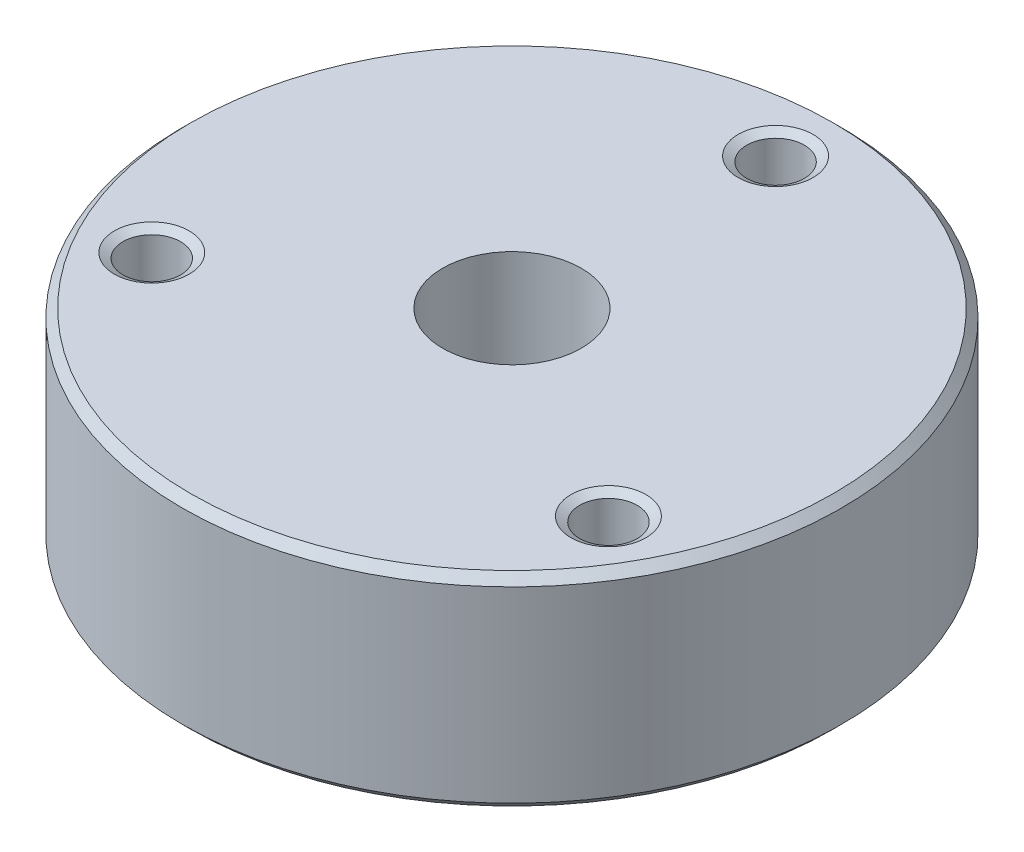
ISO-10303-21;
HEADER;
FILE_DESCRIPTION(('STEP AP214'),'2;1');
FILE_NAME('part.step','',(''),(''),'','','');
FILE_SCHEMA(('AUTOMOTIVE_DESIGN { 1 0 10303 214 1 1 1 1 }'));
ENDSEC;
DATA;
#1=APPLICATION_CONTEXT('core data for automotive mechanical design processes');
#2=APPLICATION_PROTOCOL_DEFINITION('international standard','automotive_design',2000,#1);
#3=PRODUCT_CONTEXT('',#1,'mechanical');
#4=PRODUCT('Part','Part','',(#3));
#5=PRODUCT_RELATED_PRODUCT_CATEGORY('part','',(#4));
#6=PRODUCT_DEFINITION_FORMATION('','',#4);
#7=PRODUCT_DEFINITION_CONTEXT('part definition',#1,'design');
#8=PRODUCT_DEFINITION('design','',#6,#7);
#9=PRODUCT_DEFINITION_SHAPE('','',#8);
#10=(LENGTH_UNIT() NAMED_UNIT(*) SI_UNIT(.MILLI.,.METRE.));
#11=(NAMED_UNIT(*) PLANE_ANGLE_UNIT() SI_UNIT($,.RADIAN.));
#12=(NAMED_UNIT(*) SI_UNIT($,.STERADIAN.) SOLID_ANGLE_UNIT());
#13=UNCERTAINTY_MEASURE_WITH_UNIT(LENGTH_MEASURE(1.E-05),#10,'distance_accuracy_value','');
#14=(GEOMETRIC_REPRESENTATION_CONTEXT(3) GLOBAL_UNCERTAINTY_ASSIGNED_CONTEXT((#13)) GLOBAL_UNIT_ASSIGNED_CONTEXT((#10,
#11,#12)) REPRESENTATION_CONTEXT('',''));
#15=CARTESIAN_POINT('',(0.,0.,0.));
#16=DIRECTION('',(0.,0.,1.));
#17=DIRECTION('',(1.,0.,0.));
#18=AXIS2_PLACEMENT_3D('',#15,#16,#17);
#19=CARTESIAN_POINT('',(0.,9.3345,0.));
#20=DIRECTION('',(0.,-1.,0.));
#21=DIRECTION('',(0.,0.,-1.));
#22=AXIS2_PLACEMENT_3D('',#19,#20,#21);
#23=CYLINDRICAL_SURFACE('',#22,30.1625);
#24=CARTESIAN_POINT('',(0.,-8.57249999999998,0.));
#25=DIRECTION('',(0.,1.,0.));
#26=DIRECTION('',(0.,0.,1.));
#27=AXIS2_PLACEMENT_3D('',#24,#25,#26);
#28=CIRCLE('',#27,30.1625);
#29=CARTESIAN_POINT('',(0.,-8.57249999999998,30.1625));
#30=VERTEX_POINT('',#29);
#31=EDGE_CURVE('E46',#30,#30,#28,.T.);
#32=ORIENTED_EDGE('',*,*,#31,.T.);
#33=EDGE_LOOP('',(#32));
#34=FACE_BOUND('',#33,.T.);
#35=CARTESIAN_POINT('',(0.,8.5725,0.));
#36=DIRECTION('',(0.,1.,0.));
#37=DIRECTION('',(0.,0.,1.));
#38=AXIS2_PLACEMENT_3D('',#35,#36,#37);
#39=CIRCLE('',#38,30.1625);
#40=CARTESIAN_POINT('',(0.,8.5725,30.1625));
#41=VERTEX_POINT('',#40);
#42=EDGE_CURVE('E111',#41,#41,#39,.F.);
#43=ORIENTED_EDGE('',*,*,#42,.T.);
#44=EDGE_LOOP('',(#43));
#45=FACE_BOUND('',#44,.T.);
#46=ADVANCED_FACE('F33',(#34,#45),#23,.T.);
#47=CARTESIAN_POINT('',(0.,9.3345,0.));
#48=DIRECTION('',(0.,1.,0.));
#49=DIRECTION('',(0.,0.,1.));
#50=AXIS2_PLACEMENT_3D('',#47,#48,#49);
#51=PLANE('',#50);
#52=CARTESIAN_POINT('',(0.,9.3345,0.));
#53=DIRECTION('',(0.,1.,0.));
#54=DIRECTION('',(0.,0.,1.));
#55=AXIS2_PLACEMENT_3D('',#52,#53,#54);
#56=CIRCLE('',#55,29.4005);
#57=CARTESIAN_POINT('',(0.,9.3345,29.4005));
#58=VERTEX_POINT('',#57);
#59=EDGE_CURVE('E10',#58,#58,#56,.T.);
#60=ORIENTED_EDGE('',*,*,#59,.T.);
#61=EDGE_LOOP('',(#60));
#62=FACE_BOUND('',#61,.T.);
#63=CARTESIAN_POINT('',(0.,9.3345,0.));
#64=DIRECTION('',(0.,-1.,0.));
#65=DIRECTION('',(0.,0.,-1.));
#66=AXIS2_PLACEMENT_3D('',#63,#64,#65);
#67=CIRCLE('',#66,6.34873);
#68=CARTESIAN_POINT('',(0.,9.3345,-6.34873));
#69=VERTEX_POINT('',#68);
#70=EDGE_CURVE('E55',#69,#69,#67,.T.);
#71=ORIENTED_EDGE('',*,*,#70,.T.);
#72=EDGE_LOOP('',(#71));
#73=FACE_BOUND('',#72,.T.);
#74=CARTESIAN_POINT('',(-20.8971929933186,9.3345,12.0649999999998));
#75=DIRECTION('',(0.,1.,0.));
#76=DIRECTION('',(0.,0.,1.));
#77=AXIS2_PLACEMENT_3D('',#74,#75,#76);
#78=CIRCLE('',#77,3.429);
#79=CARTESIAN_POINT('',(-20.8971929933186,9.3345,15.4939999999998));
#80=VERTEX_POINT('',#79);
#81=EDGE_CURVE('E66',#80,#80,#78,.T.);
#82=ORIENTED_EDGE('',*,*,#81,.F.);
#83=EDGE_LOOP('',(#82));
#84=FACE_BOUND('',#83,.T.);
#85=CARTESIAN_POINT('',(20.8971929933185,9.3345,12.0650000000001));
#86=DIRECTION('',(0.,1.,0.));
#87=DIRECTION('',(0.,0.,1.));
#88=AXIS2_PLACEMENT_3D('',#85,#86,#87);
#89=CIRCLE('',#88,3.429);
#90=CARTESIAN_POINT('',(20.8971929933185,9.3345,15.4940000000001));
#91=VERTEX_POINT('',#90);
#92=EDGE_CURVE('E81',#91,#91,#89,.T.);
#93=ORIENTED_EDGE('',*,*,#92,.F.);
#94=EDGE_LOOP('',(#93));
#95=FACE_BOUND('',#94,.T.);
#96=CARTESIAN_POINT('',(0.,9.3345,-24.13));
#97=DIRECTION('',(0.,1.,0.));
#98=DIRECTION('',(0.,0.,1.));
#99=AXIS2_PLACEMENT_3D('',#96,#97,#98);
#100=CIRCLE('',#99,3.429);
#101=CARTESIAN_POINT('',(0.,9.3345,-20.701));
#102=VERTEX_POINT('',#101);
#103=EDGE_CURVE('E96',#102,#102,#100,.T.);
#104=ORIENTED_EDGE('',*,*,#103,.F.);
#105=EDGE_LOOP('',(#104));
#106=FACE_BOUND('',#105,.T.);
#107=ADVANCED_FACE('F133',(#62,#73,#84,#95,#106),#51,.T.);
#108=CARTESIAN_POINT('',(0.,-9.3345,0.));
#109=DIRECTION('',(0.,1.,0.));
#110=DIRECTION('',(0.,0.,1.));
#111=AXIS2_PLACEMENT_3D('',#108,#109,#110);
#112=PLANE('',#111);
#113=CARTESIAN_POINT('',(0.,-9.3345,0.));
#114=DIRECTION('',(0.,1.,0.));
#115=DIRECTION('',(0.,0.,1.));
#116=AXIS2_PLACEMENT_3D('',#113,#114,#115);
#117=CIRCLE('',#116,29.4005);
#118=CARTESIAN_POINT('',(0.,-9.3345,29.4005));
#119=VERTEX_POINT('',#118);
#120=EDGE_CURVE('E41',#119,#119,#117,.F.);
#121=ORIENTED_EDGE('',*,*,#120,.T.);
#122=EDGE_LOOP('',(#121));
#123=FACE_BOUND('',#122,.T.);
#124=CARTESIAN_POINT('',(0.,-9.3345,0.));
#125=DIRECTION('',(0.,-1.,0.));
#126=DIRECTION('',(0.,0.,-1.));
#127=AXIS2_PLACEMENT_3D('',#124,#125,#126);
#128=CIRCLE('',#127,7.112);
#129=CARTESIAN_POINT('',(0.,-9.3345,-7.112));
#130=VERTEX_POINT('',#129);
#131=EDGE_CURVE('E63',#130,#130,#128,.T.);
#132=ORIENTED_EDGE('',*,*,#131,.F.);
#133=EDGE_LOOP('',(#132));
#134=FACE_BOUND('',#133,.T.);
#135=CARTESIAN_POINT('',(-20.8971929933186,-9.33449999999999,12.0649999999998));
#136=DIRECTION('',(0.,1.,0.));
#137=DIRECTION('',(0.,0.,1.));
#138=AXIS2_PLACEMENT_3D('',#135,#136,#137);
#139=CIRCLE('',#138,2.1971);
#140=CARTESIAN_POINT('',(-20.8971929933186,-9.33449999999999,14.2620999999998));
#141=VERTEX_POINT('',#140);
#142=EDGE_CURVE('E78',#141,#141,#139,.T.);
#143=ORIENTED_EDGE('',*,*,#142,.T.);
#144=EDGE_LOOP('',(#143));
#145=FACE_BOUND('',#144,.T.);
#146=CARTESIAN_POINT('',(20.8971929933185,-9.33449999999999,12.0650000000001));
#147=DIRECTION('',(0.,1.,0.));
#148=DIRECTION('',(0.,0.,1.));
#149=AXIS2_PLACEMENT_3D('',#146,#147,#148);
#150=CIRCLE('',#149,2.1971);
#151=CARTESIAN_POINT('',(20.8971929933185,-9.33449999999999,14.2621000000001));
#152=VERTEX_POINT('',#151);
#153=EDGE_CURVE('E93',#152,#152,#150,.T.);
#154=ORIENTED_EDGE('',*,*,#153,.T.);
#155=EDGE_LOOP('',(#154));
#156=FACE_BOUND('',#155,.T.);
#157=CARTESIAN_POINT('',(0.,-9.33449999999999,-24.13));
#158=DIRECTION('',(0.,1.,0.));
#159=DIRECTION('',(0.,0.,1.));
#160=AXIS2_PLACEMENT_3D('',#157,#158,#159);
#161=CIRCLE('',#160,2.19710000000001);
#162=CARTESIAN_POINT('',(0.,-9.33449999999999,-21.9329));
#163=VERTEX_POINT('',#162);
#164=EDGE_CURVE('E108',#163,#163,#161,.T.);
#165=ORIENTED_EDGE('',*,*,#164,.T.);
#166=EDGE_LOOP('',(#165));
#167=FACE_BOUND('',#166,.T.);
#168=ADVANCED_FACE('F137',(#123,#134,#145,#156,#167),#112,.F.);
#169=CARTESIAN_POINT('',(0.,9.3345,-24.13));
#170=DIRECTION('',(0.,1.,0.));
#171=DIRECTION('',(0.,0.,1.));
#172=AXIS2_PLACEMENT_3D('',#169,#170,#171);
#173=CYLINDRICAL_SURFACE('',#172,2.1971);
#174=ORIENTED_EDGE('',*,*,#164,.F.);
#175=EDGE_LOOP('',(#174));
#176=FACE_BOUND('',#175,.T.);
#177=CARTESIAN_POINT('',(0.,-1.0287,-24.13));
#178=DIRECTION('',(0.,1.,0.));
#179=DIRECTION('',(0.,0.,1.));
#180=AXIS2_PLACEMENT_3D('',#177,#178,#179);
#181=CIRCLE('',#180,2.1971);
#182=CARTESIAN_POINT('',(0.,-1.0287,-21.9329));
#183=VERTEX_POINT('',#182);
#184=EDGE_CURVE('E105',#183,#183,#181,.T.);
#185=ORIENTED_EDGE('',*,*,#184,.T.);
#186=EDGE_LOOP('',(#185));
#187=FACE_BOUND('',#186,.T.);
#188=ADVANCED_FACE('F141',(#176,#187),#173,.F.);
#189=CARTESIAN_POINT('',(2.63778999999999,-1.0287,-24.13));
#190=DIRECTION('',(0.,-1.,0.));
#191=DIRECTION('',(0.,0.,-1.));
#192=AXIS2_PLACEMENT_3D('',#189,#190,#191);
#193=PLANE('',#192);
#194=ORIENTED_EDGE('',*,*,#184,.F.);
#195=EDGE_LOOP('',(#194));
#196=FACE_BOUND('',#195,.T.);
#197=CARTESIAN_POINT('',(0.,-1.0287,-24.13));
#198=DIRECTION('',(0.,1.,0.));
#199=DIRECTION('',(0.,0.,1.));
#200=AXIS2_PLACEMENT_3D('',#197,#198,#199);
#201=CIRCLE('',#200,2.63778999999999);
#202=CARTESIAN_POINT('',(0.,-1.0287,-21.49221));
#203=VERTEX_POINT('',#202);
#204=EDGE_CURVE('E102',#203,#203,#201,.T.);
#205=ORIENTED_EDGE('',*,*,#204,.T.);
#206=EDGE_LOOP('',(#205));
#207=FACE_BOUND('',#206,.T.);
#208=ADVANCED_FACE('F146',(#196,#207),#193,.F.);
#209=CARTESIAN_POINT('',(0.,9.3345,-24.13));
#210=DIRECTION('',(0.,1.,0.));
#211=DIRECTION('',(0.,0.,1.));
#212=AXIS2_PLACEMENT_3D('',#209,#210,#211);
#213=CYLINDRICAL_SURFACE('',#212,2.63779);
#214=ORIENTED_EDGE('',*,*,#204,.F.);
#215=EDGE_LOOP('',(#214));
#216=FACE_BOUND('',#215,.T.);
#217=CARTESIAN_POINT('',(0.,8.87769469351447,-24.13));
#218=DIRECTION('',(0.,1.,0.));
#219=DIRECTION('',(0.,0.,1.));
#220=AXIS2_PLACEMENT_3D('',#217,#218,#219);
#221=CIRCLE('',#220,2.63779);
#222=CARTESIAN_POINT('',(0.,8.87769469351447,-21.49221));
#223=VERTEX_POINT('',#222);
#224=EDGE_CURVE('E99',#223,#223,#221,.T.);
#225=ORIENTED_EDGE('',*,*,#224,.T.);
#226=EDGE_LOOP('',(#225));
#227=FACE_BOUND('',#226,.T.);
#228=ADVANCED_FACE('F150',(#216,#227),#213,.F.);
#229=CARTESIAN_POINT('',(0.,9.3345,-24.13));
#230=DIRECTION('',(0.,1.,0.));
#231=DIRECTION('',(0.,0.,1.));
#232=AXIS2_PLACEMENT_3D('',#229,#230,#231);
#233=CONICAL_SURFACE('',#232,3.429,1.0471975511966);
#234=ORIENTED_EDGE('',*,*,#224,.F.);
#235=EDGE_LOOP('',(#234));
#236=FACE_BOUND('',#235,.T.);
#237=ORIENTED_EDGE('',*,*,#103,.T.);
#238=EDGE_LOOP('',(#237));
#239=FACE_BOUND('',#238,.T.);
#240=ADVANCED_FACE('F154',(#236,#239),#233,.F.);
#241=CARTESIAN_POINT('',(20.8971929933185,9.3345,12.0650000000001));
#242=DIRECTION('',(0.,1.,0.));
#243=DIRECTION('',(0.,0.,1.));
#244=AXIS2_PLACEMENT_3D('',#241,#242,#243);
#245=CYLINDRICAL_SURFACE('',#244,2.1971);
#246=ORIENTED_EDGE('',*,*,#153,.F.);
#247=EDGE_LOOP('',(#246));
#248=FACE_BOUND('',#247,.T.);
#249=CARTESIAN_POINT('',(20.8971929933185,-1.0287,12.0650000000001));
#250=DIRECTION('',(0.,1.,0.));
#251=DIRECTION('',(0.,0.,1.));
#252=AXIS2_PLACEMENT_3D('',#249,#250,#251);
#253=CIRCLE('',#252,2.1971);
#254=CARTESIAN_POINT('',(20.8971929933185,-1.0287,14.2621000000001));
#255=VERTEX_POINT('',#254);
#256=EDGE_CURVE('E90',#255,#255,#253,.T.);
#257=ORIENTED_EDGE('',*,*,#256,.T.);
#258=EDGE_LOOP('',(#257));
#259=FACE_BOUND('',#258,.T.);
#260=ADVANCED_FACE('F158',(#248,#259),#245,.F.);
#261=CARTESIAN_POINT('',(23.5349829933184,-1.0287,12.0650000000001));
#262=DIRECTION('',(0.,-1.,0.));
#263=DIRECTION('',(0.,0.,-1.));
#264=AXIS2_PLACEMENT_3D('',#261,#262,#263);
#265=PLANE('',#264);
#266=ORIENTED_EDGE('',*,*,#256,.F.);
#267=EDGE_LOOP('',(#266));
#268=FACE_BOUND('',#267,.T.);
#269=CARTESIAN_POINT('',(20.8971929933185,-1.0287,12.0650000000001));
#270=DIRECTION('',(0.,1.,0.));
#271=DIRECTION('',(0.,0.,1.));
#272=AXIS2_PLACEMENT_3D('',#269,#270,#271);
#273=CIRCLE('',#272,2.63778999999999);
#274=CARTESIAN_POINT('',(20.8971929933185,-1.0287,14.7027900000001));
#275=VERTEX_POINT('',#274);
#276=EDGE_CURVE('E87',#275,#275,#273,.T.);
#277=ORIENTED_EDGE('',*,*,#276,.T.);
#278=EDGE_LOOP('',(#277));
#279=FACE_BOUND('',#278,.T.);
#280=ADVANCED_FACE('F162',(#268,#279),#265,.F.);
#281=CARTESIAN_POINT('',(20.8971929933185,9.3345,12.0650000000001));
#282=DIRECTION('',(0.,1.,0.));
#283=DIRECTION('',(0.,0.,1.));
#284=AXIS2_PLACEMENT_3D('',#281,#282,#283);
#285=CYLINDRICAL_SURFACE('',#284,2.63779);
#286=ORIENTED_EDGE('',*,*,#276,.F.);
#287=EDGE_LOOP('',(#286));
#288=FACE_BOUND('',#287,.T.);
#289=CARTESIAN_POINT('',(20.8971929933185,8.87769469351447,12.0650000000001));
#290=DIRECTION('',(0.,1.,0.));
#291=DIRECTION('',(0.,0.,1.));
#292=AXIS2_PLACEMENT_3D('',#289,#290,#291);
#293=CIRCLE('',#292,2.63779);
#294=CARTESIAN_POINT('',(20.8971929933185,8.87769469351447,14.7027900000001));
#295=VERTEX_POINT('',#294);
#296=EDGE_CURVE('E84',#295,#295,#293,.T.);
#297=ORIENTED_EDGE('',*,*,#296,.T.);
#298=EDGE_LOOP('',(#297));
#299=FACE_BOUND('',#298,.T.);
#300=ADVANCED_FACE('F166',(#288,#299),#285,.F.);
#301=CARTESIAN_POINT('',(20.8971929933185,9.3345,12.0650000000001));
#302=DIRECTION('',(0.,1.,0.));
#303=DIRECTION('',(0.,0.,1.));
#304=AXIS2_PLACEMENT_3D('',#301,#302,#303);
#305=CONICAL_SURFACE('',#304,3.429,1.0471975511966);
#306=ORIENTED_EDGE('',*,*,#296,.F.);
#307=EDGE_LOOP('',(#306));
#308=FACE_BOUND('',#307,.T.);
#309=ORIENTED_EDGE('',*,*,#92,.T.);
#310=EDGE_LOOP('',(#309));
#311=FACE_BOUND('',#310,.T.);
#312=ADVANCED_FACE('F170',(#308,#311),#305,.F.);
#313=CARTESIAN_POINT('',(-20.8971929933186,9.3345,12.0649999999998));
#314=DIRECTION('',(0.,1.,0.));
#315=DIRECTION('',(0.,0.,1.));
#316=AXIS2_PLACEMENT_3D('',#313,#314,#315);
#317=CYLINDRICAL_SURFACE('',#316,2.1971);
#318=ORIENTED_EDGE('',*,*,#142,.F.);
#319=EDGE_LOOP('',(#318));
#320=FACE_BOUND('',#319,.T.);
#321=CARTESIAN_POINT('',(-20.8971929933186,-1.0287,12.0649999999998));
#322=DIRECTION('',(0.,1.,0.));
#323=DIRECTION('',(0.,0.,1.));
#324=AXIS2_PLACEMENT_3D('',#321,#322,#323);
#325=CIRCLE('',#324,2.1971);
#326=CARTESIAN_POINT('',(-20.8971929933186,-1.0287,14.2620999999998));
#327=VERTEX_POINT('',#326);
#328=EDGE_CURVE('E75',#327,#327,#325,.T.);
#329=ORIENTED_EDGE('',*,*,#328,.T.);
#330=EDGE_LOOP('',(#329));
#331=FACE_BOUND('',#330,.T.);
#332=ADVANCED_FACE('F174',(#320,#331),#317,.F.);
#333=CARTESIAN_POINT('',(-18.2594029933186,-1.0287,12.0649999999998));
#334=DIRECTION('',(0.,-1.,0.));
#335=DIRECTION('',(0.,0.,-1.));
#336=AXIS2_PLACEMENT_3D('',#333,#334,#335);
#337=PLANE('',#336);
#338=ORIENTED_EDGE('',*,*,#328,.F.);
#339=EDGE_LOOP('',(#338));
#340=FACE_BOUND('',#339,.T.);
#341=CARTESIAN_POINT('',(-20.8971929933186,-1.0287,12.0649999999998));
#342=DIRECTION('',(0.,1.,0.));
#343=DIRECTION('',(0.,0.,1.));
#344=AXIS2_PLACEMENT_3D('',#341,#342,#343);
#345=CIRCLE('',#344,2.63778999999999);
#346=CARTESIAN_POINT('',(-20.8971929933186,-1.0287,14.7027899999998));
#347=VERTEX_POINT('',#346);
#348=EDGE_CURVE('E72',#347,#347,#345,.T.);
#349=ORIENTED_EDGE('',*,*,#348,.T.);
#350=EDGE_LOOP('',(#349));
#351=FACE_BOUND('',#350,.T.);
#352=ADVANCED_FACE('F178',(#340,#351),#337,.F.);
#353=CARTESIAN_POINT('',(-20.8971929933186,9.3345,12.0649999999998));
#354=DIRECTION('',(0.,1.,0.));
#355=DIRECTION('',(0.,0.,1.));
#356=AXIS2_PLACEMENT_3D('',#353,#354,#355);
#357=CYLINDRICAL_SURFACE('',#356,2.63779);
#358=ORIENTED_EDGE('',*,*,#348,.F.);
#359=EDGE_LOOP('',(#358));
#360=FACE_BOUND('',#359,.T.);
#361=CARTESIAN_POINT('',(-20.8971929933186,8.87769469351447,12.0649999999998));
#362=DIRECTION('',(0.,1.,0.));
#363=DIRECTION('',(0.,0.,1.));
#364=AXIS2_PLACEMENT_3D('',#361,#362,#363);
#365=CIRCLE('',#364,2.63779);
#366=CARTESIAN_POINT('',(-20.8971929933186,8.87769469351447,14.7027899999998));
#367=VERTEX_POINT('',#366);
#368=EDGE_CURVE('E69',#367,#367,#365,.T.);
#369=ORIENTED_EDGE('',*,*,#368,.T.);
#370=EDGE_LOOP('',(#369));
#371=FACE_BOUND('',#370,.T.);
#372=ADVANCED_FACE('F182',(#360,#371),#357,.F.);
#373=CARTESIAN_POINT('',(-20.8971929933186,9.3345,12.0649999999998));
#374=DIRECTION('',(0.,1.,0.));
#375=DIRECTION('',(0.,0.,1.));
#376=AXIS2_PLACEMENT_3D('',#373,#374,#375);
#377=CONICAL_SURFACE('',#376,3.429,1.0471975511966);
#378=ORIENTED_EDGE('',*,*,#368,.F.);
#379=EDGE_LOOP('',(#378));
#380=FACE_BOUND('',#379,.T.);
#381=ORIENTED_EDGE('',*,*,#81,.T.);
#382=EDGE_LOOP('',(#381));
#383=FACE_BOUND('',#382,.T.);
#384=ADVANCED_FACE('F186',(#380,#383),#377,.F.);
#385=CARTESIAN_POINT('',(0.,-9.3345,0.));
#386=DIRECTION('',(0.,-1.,0.));
#387=DIRECTION('',(0.,0.,-1.));
#388=AXIS2_PLACEMENT_3D('',#385,#386,#387);
#389=CONICAL_SURFACE('',#388,7.112,0.78539816339745);
#390=CARTESIAN_POINT('',(0.,-8.5852,0.));
#391=DIRECTION('',(0.,-1.,0.));
#392=DIRECTION('',(0.,0.,-1.));
#393=AXIS2_PLACEMENT_3D('',#390,#391,#392);
#394=CIRCLE('',#393,6.3627);
#395=CARTESIAN_POINT('',(0.,-8.5852,-6.3627));
#396=VERTEX_POINT('',#395);
#397=EDGE_CURVE('E37',#396,#396,#394,.F.);
#398=ORIENTED_EDGE('',*,*,#397,.T.);
#399=EDGE_LOOP('',(#398));
#400=FACE_BOUND('',#399,.T.);
#401=ORIENTED_EDGE('',*,*,#131,.T.);
#402=EDGE_LOOP('',(#401));
#403=FACE_BOUND('',#402,.T.);
#404=ADVANCED_FACE('F128',(#400,#403),#389,.F.);
#405=CARTESIAN_POINT('',(0.,-9.3345,0.));
#406=DIRECTION('',(0.,-1.,0.));
#407=DIRECTION('',(0.,0.,-1.));
#408=AXIS2_PLACEMENT_3D('',#405,#406,#407);
#409=CYLINDRICAL_SURFACE('',#408,6.34873);
#410=CARTESIAN_POINT('',(0.,-6.15110597715218,0.));
#411=DIRECTION('',(0.,-1.,0.));
#412=DIRECTION('',(0.,0.,-1.));
#413=AXIS2_PLACEMENT_3D('',#410,#411,#412);
#414=CIRCLE('',#413,6.34873);
#415=CARTESIAN_POINT('',(0.,-6.15110597715218,-6.34873));
#416=VERTEX_POINT('',#415);
#417=EDGE_CURVE('E49',#416,#416,#414,.T.);
#418=ORIENTED_EDGE('',*,*,#417,.T.);
#419=EDGE_LOOP('',(#418));
#420=FACE_BOUND('',#419,.T.);
#421=ORIENTED_EDGE('',*,*,#70,.F.);
#422=EDGE_LOOP('',(#421));
#423=FACE_BOUND('',#422,.T.);
#424=ADVANCED_FACE('F120',(#420,#423),#409,.F.);
#425=CARTESIAN_POINT('',(0.,-8.57249999999998,0.));
#426=DIRECTION('',(0.,1.,0.));
#427=DIRECTION('',(0.,0.,1.));
#428=AXIS2_PLACEMENT_3D('',#425,#426,#427);
#429=CONICAL_SURFACE('',#428,30.1625,0.785398163397451);
#430=ORIENTED_EDGE('',*,*,#120,.F.);
#431=EDGE_LOOP('',(#430));
#432=FACE_BOUND('',#431,.T.);
#433=ORIENTED_EDGE('',*,*,#31,.F.);
#434=EDGE_LOOP('',(#433));
#435=FACE_BOUND('',#434,.T.);
#436=ADVANCED_FACE('F118',(#432,#435),#429,.T.);
#437=CARTESIAN_POINT('',(0.,9.3345,0.));
#438=DIRECTION('',(0.,-1.,0.));
#439=DIRECTION('',(0.,0.,-1.));
#440=AXIS2_PLACEMENT_3D('',#437,#438,#439);
#441=CONICAL_SURFACE('',#440,29.4005,0.785398163397437);
#442=ORIENTED_EDGE('',*,*,#42,.F.);
#443=EDGE_LOOP('',(#442));
#444=FACE_BOUND('',#443,.T.);
#445=ORIENTED_EDGE('',*,*,#59,.F.);
#446=EDGE_LOOP('',(#445));
#447=FACE_BOUND('',#446,.T.);
#448=ADVANCED_FACE('F35',(#444,#447),#441,.T.);
#449=CARTESIAN_POINT('',(0.,-9.3345,0.));
#450=DIRECTION('',(0.,-1.,0.));
#451=DIRECTION('',(0.,0.,-1.));
#452=AXIS2_PLACEMENT_3D('',#449,#450,#451);
#453=CYLINDRICAL_SURFACE('',#452,6.3627);
#454=CARTESIAN_POINT('',(0.,-6.1595,0.));
#455=DIRECTION('',(0.,-1.,0.));
#456=DIRECTION('',(0.,0.,-1.));
#457=AXIS2_PLACEMENT_3D('',#454,#455,#456);
#458=CIRCLE('',#457,6.3627);
#459=CARTESIAN_POINT('',(0.,-6.1595,-6.3627));
#460=VERTEX_POINT('',#459);
#461=EDGE_CURVE('E51',#460,#460,#458,.T.);
#462=ORIENTED_EDGE('',*,*,#461,.F.);
#463=EDGE_LOOP('',(#462));
#464=FACE_BOUND('',#463,.T.);
#465=ORIENTED_EDGE('',*,*,#397,.F.);
#466=EDGE_LOOP('',(#465));
#467=FACE_BOUND('',#466,.T.);
#468=ADVANCED_FACE('F126',(#464,#467),#453,.F.);
#469=CARTESIAN_POINT('',(0.,-6.1595,0.));
#470=DIRECTION('',(0.,-1.,0.));
#471=DIRECTION('',(0.,0.,-1.));
#472=AXIS2_PLACEMENT_3D('',#469,#470,#471);
#473=CONICAL_SURFACE('',#472,6.3627,1.02974425867665);
#474=ORIENTED_EDGE('',*,*,#461,.T.);
#475=EDGE_LOOP('',(#474));
#476=FACE_BOUND('',#475,.T.);
#477=ORIENTED_EDGE('',*,*,#417,.F.);
#478=EDGE_LOOP('',(#477));
#479=FACE_BOUND('',#478,.T.);
#480=ADVANCED_FACE('F196',(#476,#479),#473,.F.);
#481=CLOSED_SHELL('',(#46,#107,#168,#188,#208,#228,#240,#260,#280,#300,#312,#332,#352,#372,#384,
#404,#424,#436,#448,#468,#480));
#482=MANIFOLD_SOLID_BREP('B2',#481);
#483=ADVANCED_BREP_SHAPE_REPRESENTATION('',(#18,#482),#14);
#484=SHAPE_DEFINITION_REPRESENTATION(#9,#483);
ENDSEC;
END-ISO-10303-21;
